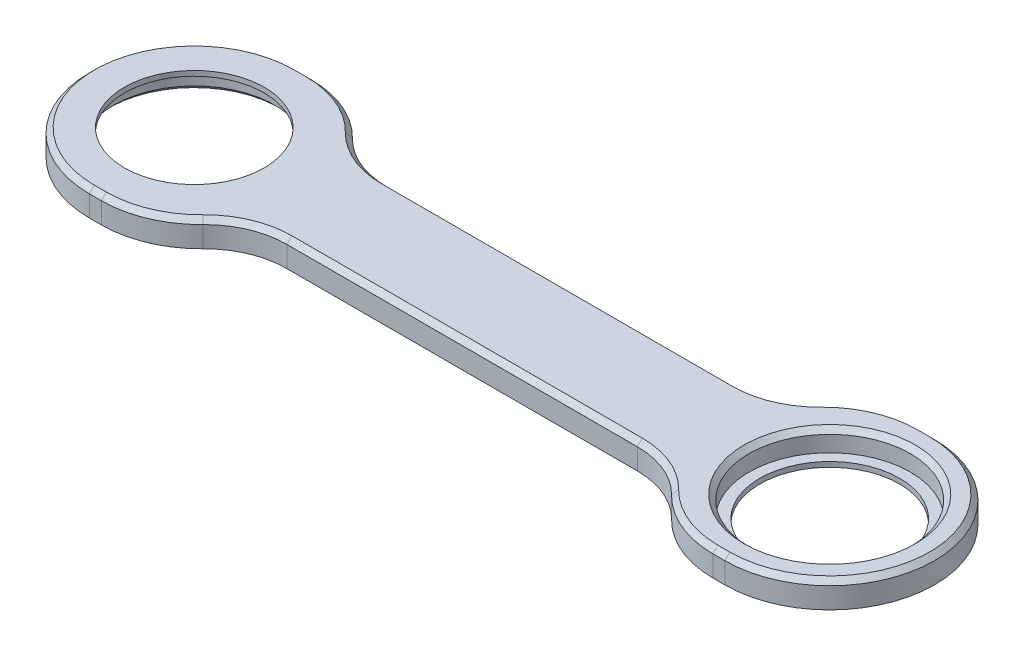
ISO-10303-21;
HEADER;
FILE_DESCRIPTION(('STEP AP214'),'2;1');
FILE_NAME('part.step','',(''),(''),'','','');
FILE_SCHEMA(('AUTOMOTIVE_DESIGN { 1 0 10303 214 1 1 1 1 }'));
ENDSEC;
DATA;
#1=APPLICATION_CONTEXT('core data for automotive mechanical design processes');
#2=APPLICATION_PROTOCOL_DEFINITION('international standard','automotive_design',2000,#1);
#3=PRODUCT_CONTEXT('',#1,'mechanical');
#4=PRODUCT('Part','Part','',(#3));
#5=PRODUCT_RELATED_PRODUCT_CATEGORY('part','',(#4));
#6=PRODUCT_DEFINITION_FORMATION('','',#4);
#7=PRODUCT_DEFINITION_CONTEXT('part definition',#1,'design');
#8=PRODUCT_DEFINITION('design','',#6,#7);
#9=PRODUCT_DEFINITION_SHAPE('','',#8);
#10=(LENGTH_UNIT() NAMED_UNIT(*) SI_UNIT(.MILLI.,.METRE.));
#11=(NAMED_UNIT(*) PLANE_ANGLE_UNIT() SI_UNIT($,.RADIAN.));
#12=(NAMED_UNIT(*) SI_UNIT($,.STERADIAN.) SOLID_ANGLE_UNIT());
#13=UNCERTAINTY_MEASURE_WITH_UNIT(LENGTH_MEASURE(1.E-05),#10,'distance_accuracy_value','');
#14=(GEOMETRIC_REPRESENTATION_CONTEXT(3) GLOBAL_UNCERTAINTY_ASSIGNED_CONTEXT((#13)) GLOBAL_UNIT_ASSIGNED_CONTEXT((#10,
#11,#12)) REPRESENTATION_CONTEXT('',''));
#15=CARTESIAN_POINT('',(0.,0.,0.));
#16=DIRECTION('',(0.,0.,1.));
#17=DIRECTION('',(1.,0.,0.));
#18=AXIS2_PLACEMENT_3D('',#15,#16,#17);
#19=CARTESIAN_POINT('',(-63.625,5.2,0.));
#20=DIRECTION('',(0.,-1.,0.));
#21=DIRECTION('',(0.,0.,-1.));
#22=AXIS2_PLACEMENT_3D('',#19,#20,#21);
#23=CYLINDRICAL_SURFACE('',#22,16.15);
#24=CARTESIAN_POINT('',(-63.625,0.99999999999997,0.));
#25=DIRECTION('',(0.,1.,0.));
#26=DIRECTION('',(0.,0.,1.));
#27=AXIS2_PLACEMENT_3D('',#24,#25,#26);
#28=CIRCLE('',#27,16.15);
#29=CARTESIAN_POINT('',(-63.625,0.99999999999997,16.15));
#30=VERTEX_POINT('',#29);
#31=EDGE_CURVE('E11',#30,#30,#28,.F.);
#32=ORIENTED_EDGE('',*,*,#31,.T.);
#33=EDGE_LOOP('',(#32));
#34=FACE_BOUND('',#33,.T.);
#35=CARTESIAN_POINT('',(-63.625,4.2,0.));
#36=DIRECTION('',(0.,1.,0.));
#37=DIRECTION('',(0.,0.,1.));
#38=AXIS2_PLACEMENT_3D('',#35,#36,#37);
#39=CIRCLE('',#38,16.15);
#40=CARTESIAN_POINT('',(-63.625,4.2,16.15));
#41=VERTEX_POINT('',#40);
#42=EDGE_CURVE('E413',#41,#41,#39,.T.);
#43=ORIENTED_EDGE('',*,*,#42,.T.);
#44=EDGE_LOOP('',(#43));
#45=FACE_BOUND('',#44,.T.);
#46=ADVANCED_FACE('F41',(#34,#45),#23,.F.);
#47=CARTESIAN_POINT('',(63.625,5.2,0.));
#48=DIRECTION('',(0.,-1.,0.));
#49=DIRECTION('',(0.,0.,-1.));
#50=AXIS2_PLACEMENT_3D('',#47,#48,#49);
#51=CYLINDRICAL_SURFACE('',#50,16.15);
#52=CARTESIAN_POINT('',(63.625,4.20000000000002,0.));
#53=DIRECTION('',(0.,1.,0.));
#54=DIRECTION('',(0.,0.,1.));
#55=AXIS2_PLACEMENT_3D('',#52,#53,#54);
#56=CIRCLE('',#55,16.15);
#57=CARTESIAN_POINT('',(63.625,4.20000000000002,16.15));
#58=VERTEX_POINT('',#57);
#59=EDGE_CURVE('E337',#58,#58,#56,.T.);
#60=ORIENTED_EDGE('',*,*,#59,.T.);
#61=EDGE_LOOP('',(#60));
#62=FACE_BOUND('',#61,.T.);
#63=CARTESIAN_POINT('',(63.625,1.,0.));
#64=DIRECTION('',(0.,-1.,0.));
#65=DIRECTION('',(0.,0.,-1.));
#66=AXIS2_PLACEMENT_3D('',#63,#64,#65);
#67=CIRCLE('',#66,16.15);
#68=CARTESIAN_POINT('',(63.625,1.,-16.15));
#69=VERTEX_POINT('',#68);
#70=EDGE_CURVE('E367',#69,#69,#67,.T.);
#71=ORIENTED_EDGE('',*,*,#70,.T.);
#72=EDGE_LOOP('',(#71));
#73=FACE_BOUND('',#72,.T.);
#74=ADVANCED_FACE('F432',(#62,#73),#51,.F.);
#75=CARTESIAN_POINT('',(35.1066134191231,5.2,26.5457507457693));
#76=DIRECTION('',(0.,-1.,0.));
#77=DIRECTION('',(0.,0.,-1.));
#78=AXIS2_PLACEMENT_3D('',#75,#76,#77);
#79=CYLINDRICAL_SURFACE('',#78,16.5457507457693);
#80=DIRECTION('',(0.,-1.,0.));
#81=VECTOR('',#80,1.);
#82=CARTESIAN_POINT('',(46.9387183735375,5.2,14.9801482932877));
#83=LINE('',#82,#81);
#84=CARTESIAN_POINT('',(46.9387183735375,0.,14.9801482932877));
#85=VERTEX_POINT('',#84);
#86=CARTESIAN_POINT('',(46.9387183735375,4.2,14.9801482932877));
#87=VERTEX_POINT('',#86);
#88=EDGE_CURVE('E278',#85,#87,#83,.F.);
#89=ORIENTED_EDGE('',*,*,#88,.T.);
#90=CARTESIAN_POINT('',(35.1066134191231,4.2,26.5457507457693));
#91=DIRECTION('',(0.,1.,0.));
#92=DIRECTION('',(0.,0.,1.));
#93=AXIS2_PLACEMENT_3D('',#90,#91,#92);
#94=CIRCLE('',#93,16.5457507457693);
#95=CARTESIAN_POINT('',(35.106613419123,4.2,9.99999999999998));
#96=VERTEX_POINT('',#95);
#97=EDGE_CURVE('E57',#87,#96,#94,.T.);
#98=ORIENTED_EDGE('',*,*,#97,.T.);
#99=DIRECTION('',(0.,-1.,0.));
#100=VECTOR('',#99,1.);
#101=CARTESIAN_POINT('',(35.106613419123,5.2,9.99999999999998));
#102=LINE('',#101,#100);
#103=CARTESIAN_POINT('',(35.106613419123,0.,9.99999999999998));
#104=VERTEX_POINT('',#103);
#105=EDGE_CURVE('E256',#96,#104,#102,.T.);
#106=ORIENTED_EDGE('',*,*,#105,.T.);
#107=CARTESIAN_POINT('',(35.1066134191231,0.,26.5457507457693));
#108=DIRECTION('',(0.,1.,0.));
#109=DIRECTION('',(0.,0.,1.));
#110=AXIS2_PLACEMENT_3D('',#107,#108,#109);
#111=CIRCLE('',#110,16.5457507457693);
#112=EDGE_CURVE('E229',#85,#104,#111,.T.);
#113=ORIENTED_EDGE('',*,*,#112,.F.);
#114=EDGE_LOOP('',(#89,#98,#106,#113));
#115=FACE_BOUND('',#114,.T.);
#116=ADVANCED_FACE('F438',(#115),#79,.F.);
#117=CARTESIAN_POINT('',(0.,5.2,21.));
#118=DIRECTION('',(0.,0.,1.));
#119=DIRECTION('',(1.,0.,0.));
#120=AXIS2_PLACEMENT_3D('',#117,#118,#119);
#121=PLANE('',#120);
#122=DIRECTION('',(0.,-1.,0.));
#123=VECTOR('',#122,1.);
#124=CARTESIAN_POINT('',(63.625,5.2,21.));
#125=LINE('',#124,#123);
#126=CARTESIAN_POINT('',(63.625,4.2,21.));
#127=VERTEX_POINT('',#126);
#128=CARTESIAN_POINT('',(63.625,0.,21.));
#129=VERTEX_POINT('',#128);
#130=EDGE_CURVE('E204',#127,#129,#125,.T.);
#131=ORIENTED_EDGE('',*,*,#130,.F.);
#132=DIRECTION('',(-1.,0.,0.));
#133=VECTOR('',#132,1.);
#134=CARTESIAN_POINT('',(0.,4.2,21.));
#135=LINE('',#134,#133);
#136=CARTESIAN_POINT('',(61.2410067812604,4.2,21.));
#137=VERTEX_POINT('',#136);
#138=EDGE_CURVE('E354',#127,#137,#135,.T.);
#139=ORIENTED_EDGE('',*,*,#138,.T.);
#140=DIRECTION('',(0.,-1.,0.));
#141=VECTOR('',#140,1.);
#142=CARTESIAN_POINT('',(61.2410067812604,5.2,21.));
#143=LINE('',#142,#141);
#144=CARTESIAN_POINT('',(61.2410067812604,0.,21.));
#145=VERTEX_POINT('',#144);
#146=EDGE_CURVE('E214',#137,#145,#143,.T.);
#147=ORIENTED_EDGE('',*,*,#146,.T.);
#148=DIRECTION('',(-1.,0.,0.));
#149=VECTOR('',#148,1.);
#150=CARTESIAN_POINT('',(0.,0.,21.));
#151=LINE('',#150,#149);
#152=EDGE_CURVE('E222',#129,#145,#151,.T.);
#153=ORIENTED_EDGE('',*,*,#152,.F.);
#154=EDGE_LOOP('',(#131,#139,#147,#153));
#155=FACE_BOUND('',#154,.T.);
#156=ADVANCED_FACE('F226',(#155),#121,.T.);
#157=CARTESIAN_POINT('',(63.625,5.2,0.));
#158=DIRECTION('',(0.,-1.,0.));
#159=DIRECTION('',(0.,0.,-1.));
#160=AXIS2_PLACEMENT_3D('',#157,#158,#159);
#161=CYLINDRICAL_SURFACE('',#160,21.);
#162=DIRECTION('',(0.,-1.,0.));
#163=VECTOR('',#162,1.);
#164=CARTESIAN_POINT('',(63.625,5.2,-21.));
#165=LINE('',#164,#163);
#166=CARTESIAN_POINT('',(63.625,4.2,-21.));
#167=VERTEX_POINT('',#166);
#168=CARTESIAN_POINT('',(63.625,0.,-21.));
#169=VERTEX_POINT('',#168);
#170=EDGE_CURVE('E215',#167,#169,#165,.T.);
#171=ORIENTED_EDGE('',*,*,#170,.F.);
#172=CARTESIAN_POINT('',(63.625,4.19999999999999,0.));
#173=DIRECTION('',(0.,1.,0.));
#174=DIRECTION('',(0.,0.,1.));
#175=AXIS2_PLACEMENT_3D('',#172,#173,#174);
#176=CIRCLE('',#175,21.);
#177=EDGE_CURVE('E210',#167,#127,#176,.F.);
#178=ORIENTED_EDGE('',*,*,#177,.T.);
#179=ORIENTED_EDGE('',*,*,#130,.T.);
#180=CARTESIAN_POINT('',(63.625,0.,0.));
#181=DIRECTION('',(0.,1.,0.));
#182=DIRECTION('',(0.,0.,1.));
#183=AXIS2_PLACEMENT_3D('',#180,#181,#182);
#184=CIRCLE('',#183,21.);
#185=EDGE_CURVE('E208',#129,#169,#184,.T.);
#186=ORIENTED_EDGE('',*,*,#185,.T.);
#187=EDGE_LOOP('',(#171,#178,#179,#186));
#188=FACE_BOUND('',#187,.T.);
#189=ADVANCED_FACE('F207',(#188),#161,.T.);
#190=CARTESIAN_POINT('',(0.,5.2,-21.));
#191=DIRECTION('',(0.,0.,1.));
#192=DIRECTION('',(1.,0.,0.));
#193=AXIS2_PLACEMENT_3D('',#190,#191,#192);
#194=PLANE('',#193);
#195=DIRECTION('',(0.,1.,0.));
#196=VECTOR('',#195,1.);
#197=CARTESIAN_POINT('',(61.2410067812603,5.2,-21.));
#198=LINE('',#197,#196);
#199=CARTESIAN_POINT('',(61.2410067812603,0.,-21.));
#200=VERTEX_POINT('',#199);
#201=CARTESIAN_POINT('',(61.2410067812603,4.2,-21.));
#202=VERTEX_POINT('',#201);
#203=EDGE_CURVE('E282',#200,#202,#198,.T.);
#204=ORIENTED_EDGE('',*,*,#203,.T.);
#205=DIRECTION('',(1.,0.,0.));
#206=VECTOR('',#205,1.);
#207=CARTESIAN_POINT('',(63.625,4.2,-21.));
#208=LINE('',#207,#206);
#209=EDGE_CURVE('E350',#202,#167,#208,.T.);
#210=ORIENTED_EDGE('',*,*,#209,.T.);
#211=ORIENTED_EDGE('',*,*,#170,.T.);
#212=DIRECTION('',(-1.,0.,0.));
#213=VECTOR('',#212,1.);
#214=CARTESIAN_POINT('',(0.,0.,-21.));
#215=LINE('',#214,#213);
#216=EDGE_CURVE('E224',#169,#200,#215,.T.);
#217=ORIENTED_EDGE('',*,*,#216,.T.);
#218=EDGE_LOOP('',(#204,#210,#211,#217));
#219=FACE_BOUND('',#218,.T.);
#220=ADVANCED_FACE('F465',(#219),#194,.F.);
#221=CARTESIAN_POINT('',(35.1066134191231,5.2,-26.5457507457693));
#222=DIRECTION('',(0.,-1.,0.));
#223=DIRECTION('',(0.,0.,-1.));
#224=AXIS2_PLACEMENT_3D('',#221,#222,#223);
#225=CYLINDRICAL_SURFACE('',#224,16.5457507457693);
#226=DIRECTION('',(0.,-1.,0.));
#227=VECTOR('',#226,1.);
#228=CARTESIAN_POINT('',(35.106613419123,5.2,-9.99999999999999));
#229=LINE('',#228,#227);
#230=CARTESIAN_POINT('',(35.106613419123,4.2,-9.99999999999999));
#231=VERTEX_POINT('',#230);
#232=CARTESIAN_POINT('',(35.106613419123,0.,-9.99999999999999));
#233=VERTEX_POINT('',#232);
#234=EDGE_CURVE('E266',#231,#233,#229,.T.);
#235=ORIENTED_EDGE('',*,*,#234,.F.);
#236=CARTESIAN_POINT('',(35.1066134191231,4.2,-26.5457507457693));
#237=DIRECTION('',(0.,1.,0.));
#238=DIRECTION('',(0.,0.,1.));
#239=AXIS2_PLACEMENT_3D('',#236,#237,#238);
#240=CIRCLE('',#239,16.5457507457693);
#241=CARTESIAN_POINT('',(46.9387183735375,4.2,-14.9801482932877));
#242=VERTEX_POINT('',#241);
#243=EDGE_CURVE('E342',#231,#242,#240,.T.);
#244=ORIENTED_EDGE('',*,*,#243,.T.);
#245=DIRECTION('',(0.,-1.,0.));
#246=VECTOR('',#245,1.);
#247=CARTESIAN_POINT('',(46.9387183735375,5.2,-14.9801482932877));
#248=LINE('',#247,#246);
#249=CARTESIAN_POINT('',(46.9387183735375,0.,-14.9801482932877));
#250=VERTEX_POINT('',#249);
#251=EDGE_CURVE('E280',#242,#250,#248,.T.);
#252=ORIENTED_EDGE('',*,*,#251,.T.);
#253=CARTESIAN_POINT('',(35.1066134191231,0.,-26.5457507457693));
#254=DIRECTION('',(0.,1.,0.));
#255=DIRECTION('',(0.,0.,1.));
#256=AXIS2_PLACEMENT_3D('',#253,#254,#255);
#257=CIRCLE('',#256,16.5457507457693);
#258=EDGE_CURVE('E975',#233,#250,#257,.T.);
#259=ORIENTED_EDGE('',*,*,#258,.F.);
#260=EDGE_LOOP('',(#235,#244,#252,#259));
#261=FACE_BOUND('',#260,.T.);
#262=ADVANCED_FACE('F472',(#261),#225,.F.);
#263=CARTESIAN_POINT('',(0.,5.2,-9.99999999999999));
#264=DIRECTION('',(0.,0.,-1.));
#265=DIRECTION('',(-1.,0.,0.));
#266=AXIS2_PLACEMENT_3D('',#263,#264,#265);
#267=PLANE('',#266);
#268=DIRECTION('',(0.,-1.,0.));
#269=VECTOR('',#268,1.);
#270=CARTESIAN_POINT('',(-35.106613419123,5.2,-9.99999999999999));
#271=LINE('',#270,#269);
#272=CARTESIAN_POINT('',(-35.106613419123,4.2,-9.99999999999999));
#273=VERTEX_POINT('',#272);
#274=CARTESIAN_POINT('',(-35.106613419123,0.,-9.99999999999999));
#275=VERTEX_POINT('',#274);
#276=EDGE_CURVE('E264',#273,#275,#271,.T.);
#277=ORIENTED_EDGE('',*,*,#276,.F.);
#278=DIRECTION('',(1.,0.,0.));
#279=VECTOR('',#278,1.);
#280=CARTESIAN_POINT('',(0.,4.20000000000003,-9.99999999999999));
#281=LINE('',#280,#279);
#282=EDGE_CURVE('E335',#273,#231,#281,.T.);
#283=ORIENTED_EDGE('',*,*,#282,.T.);
#284=ORIENTED_EDGE('',*,*,#234,.T.);
#285=DIRECTION('',(1.,0.,0.));
#286=VECTOR('',#285,1.);
#287=CARTESIAN_POINT('',(0.,0.,-9.99999999999999));
#288=LINE('',#287,#286);
#289=EDGE_CURVE('E977',#275,#233,#288,.T.);
#290=ORIENTED_EDGE('',*,*,#289,.F.);
#291=EDGE_LOOP('',(#277,#283,#284,#290));
#292=FACE_BOUND('',#291,.T.);
#293=ADVANCED_FACE('F468',(#292),#267,.T.);
#294=CARTESIAN_POINT('',(-35.1066134191231,5.2,-26.5457507457693));
#295=DIRECTION('',(0.,-1.,0.));
#296=DIRECTION('',(0.,0.,-1.));
#297=AXIS2_PLACEMENT_3D('',#294,#295,#296);
#298=CYLINDRICAL_SURFACE('',#297,16.5457507457693);
#299=DIRECTION('',(0.,-1.,0.));
#300=VECTOR('',#299,1.);
#301=CARTESIAN_POINT('',(-46.9387183735375,5.2,-14.9801482932877));
#302=LINE('',#301,#300);
#303=CARTESIAN_POINT('',(-46.9387183735375,0.,-14.9801482932877));
#304=VERTEX_POINT('',#303);
#305=CARTESIAN_POINT('',(-46.9387183735375,4.2,-14.9801482932877));
#306=VERTEX_POINT('',#305);
#307=EDGE_CURVE('E287',#304,#306,#302,.F.);
#308=ORIENTED_EDGE('',*,*,#307,.T.);
#309=CARTESIAN_POINT('',(-35.1066134191231,4.2,-26.5457507457693));
#310=DIRECTION('',(0.,1.,0.));
#311=DIRECTION('',(0.,0.,1.));
#312=AXIS2_PLACEMENT_3D('',#309,#310,#311);
#313=CIRCLE('',#312,16.5457507457693);
#314=EDGE_CURVE('E340',#306,#273,#313,.T.);
#315=ORIENTED_EDGE('',*,*,#314,.T.);
#316=ORIENTED_EDGE('',*,*,#276,.T.);
#317=CARTESIAN_POINT('',(-35.1066134191231,0.,-26.5457507457693));
#318=DIRECTION('',(0.,1.,0.));
#319=DIRECTION('',(0.,0.,1.));
#320=AXIS2_PLACEMENT_3D('',#317,#318,#319);
#321=CIRCLE('',#320,16.5457507457693);
#322=EDGE_CURVE('E249',#304,#275,#321,.T.);
#323=ORIENTED_EDGE('',*,*,#322,.F.);
#324=EDGE_LOOP('',(#308,#315,#316,#323));
#325=FACE_BOUND('',#324,.T.);
#326=ADVANCED_FACE('F463',(#325),#298,.F.);
#327=DIRECTION('',(0.,-1.,0.));
#328=VECTOR('',#327,1.);
#329=CARTESIAN_POINT('',(-63.625,5.2,-21.));
#330=LINE('',#329,#328);
#331=CARTESIAN_POINT('',(-63.625,4.2,-21.));
#332=VERTEX_POINT('',#331);
#333=CARTESIAN_POINT('',(-63.625,0.,-21.));
#334=VERTEX_POINT('',#333);
#335=EDGE_CURVE('E262',#332,#334,#330,.T.);
#336=ORIENTED_EDGE('',*,*,#335,.F.);
#337=DIRECTION('',(1.,0.,0.));
#338=VECTOR('',#337,1.);
#339=CARTESIAN_POINT('',(-61.2410067812603,4.2,-21.));
#340=LINE('',#339,#338);
#341=CARTESIAN_POINT('',(-61.2410067812603,4.2,-21.));
#342=VERTEX_POINT('',#341);
#343=EDGE_CURVE('E348',#332,#342,#340,.T.);
#344=ORIENTED_EDGE('',*,*,#343,.T.);
#345=DIRECTION('',(0.,1.,0.));
#346=VECTOR('',#345,1.);
#347=CARTESIAN_POINT('',(-61.2410067812603,0.,-21.));
#348=LINE('',#347,#346);
#349=CARTESIAN_POINT('',(-61.2410067812603,0.,-21.));
#350=VERTEX_POINT('',#349);
#351=EDGE_CURVE('E285',#342,#350,#348,.F.);
#352=ORIENTED_EDGE('',*,*,#351,.T.);
#353=EDGE_CURVE('E244',#350,#334,#215,.T.);
#354=ORIENTED_EDGE('',*,*,#353,.T.);
#355=EDGE_LOOP('',(#336,#344,#352,#354));
#356=FACE_BOUND('',#355,.T.);
#357=ADVANCED_FACE('F460',(#356),#194,.F.);
#358=CARTESIAN_POINT('',(-63.625,5.2,0.));
#359=DIRECTION('',(0.,-1.,0.));
#360=DIRECTION('',(0.,0.,-1.));
#361=AXIS2_PLACEMENT_3D('',#358,#359,#360);
#362=CYLINDRICAL_SURFACE('',#361,21.);
#363=DIRECTION('',(0.,-1.,0.));
#364=VECTOR('',#363,1.);
#365=CARTESIAN_POINT('',(-63.625,5.2,21.));
#366=LINE('',#365,#364);
#367=CARTESIAN_POINT('',(-63.625,4.2,21.));
#368=VERTEX_POINT('',#367);
#369=CARTESIAN_POINT('',(-63.625,0.,21.));
#370=VERTEX_POINT('',#369);
#371=EDGE_CURVE('E260',#368,#370,#366,.T.);
#372=ORIENTED_EDGE('',*,*,#371,.F.);
#373=CARTESIAN_POINT('',(-63.625,4.2,0.));
#374=DIRECTION('',(0.,1.,0.));
#375=DIRECTION('',(0.,0.,1.));
#376=AXIS2_PLACEMENT_3D('',#373,#374,#375);
#377=CIRCLE('',#376,21.);
#378=EDGE_CURVE('E352',#368,#332,#377,.F.);
#379=ORIENTED_EDGE('',*,*,#378,.T.);
#380=ORIENTED_EDGE('',*,*,#335,.T.);
#381=CARTESIAN_POINT('',(-63.625,0.,0.));
#382=DIRECTION('',(0.,1.,0.));
#383=DIRECTION('',(0.,0.,1.));
#384=AXIS2_PLACEMENT_3D('',#381,#382,#383);
#385=CIRCLE('',#384,21.);
#386=EDGE_CURVE('E237',#334,#370,#385,.T.);
#387=ORIENTED_EDGE('',*,*,#386,.T.);
#388=EDGE_LOOP('',(#372,#379,#380,#387));
#389=FACE_BOUND('',#388,.T.);
#390=ADVANCED_FACE('F456',(#389),#362,.T.);
#391=DIRECTION('',(0.,-1.,0.));
#392=VECTOR('',#391,1.);
#393=CARTESIAN_POINT('',(-61.2410067812604,5.2,21.));
#394=LINE('',#393,#392);
#395=CARTESIAN_POINT('',(-61.2410067812604,0.,21.));
#396=VERTEX_POINT('',#395);
#397=CARTESIAN_POINT('',(-61.2410067812604,4.2,21.));
#398=VERTEX_POINT('',#397);
#399=EDGE_CURVE('E292',#396,#398,#394,.F.);
#400=ORIENTED_EDGE('',*,*,#399,.T.);
#401=DIRECTION('',(-1.,0.,0.));
#402=VECTOR('',#401,1.);
#403=CARTESIAN_POINT('',(0.,4.20000000000001,21.));
#404=LINE('',#403,#402);
#405=EDGE_CURVE('E295',#398,#368,#404,.T.);
#406=ORIENTED_EDGE('',*,*,#405,.T.);
#407=ORIENTED_EDGE('',*,*,#371,.T.);
#408=EDGE_CURVE('E231',#396,#370,#151,.T.);
#409=ORIENTED_EDGE('',*,*,#408,.F.);
#410=EDGE_LOOP('',(#400,#406,#407,#409));
#411=FACE_BOUND('',#410,.T.);
#412=ADVANCED_FACE('F452',(#411),#121,.T.);
#413=CARTESIAN_POINT('',(-35.1066134191231,5.2,26.5457507457693));
#414=DIRECTION('',(0.,-1.,0.));
#415=DIRECTION('',(0.,0.,-1.));
#416=AXIS2_PLACEMENT_3D('',#413,#414,#415);
#417=CYLINDRICAL_SURFACE('',#416,16.5457507457693);
#418=DIRECTION('',(0.,-1.,0.));
#419=VECTOR('',#418,1.);
#420=CARTESIAN_POINT('',(-35.106613419123,5.2,9.99999999999998));
#421=LINE('',#420,#419);
#422=CARTESIAN_POINT('',(-35.106613419123,4.2,9.99999999999998));
#423=VERTEX_POINT('',#422);
#424=CARTESIAN_POINT('',(-35.106613419123,0.,9.99999999999998));
#425=VERTEX_POINT('',#424);
#426=EDGE_CURVE('E258',#423,#425,#421,.T.);
#427=ORIENTED_EDGE('',*,*,#426,.F.);
#428=CARTESIAN_POINT('',(-35.1066134191231,4.2,26.5457507457693));
#429=DIRECTION('',(0.,1.,0.));
#430=DIRECTION('',(0.,0.,1.));
#431=AXIS2_PLACEMENT_3D('',#428,#429,#430);
#432=CIRCLE('',#431,16.5457507457693);
#433=CARTESIAN_POINT('',(-46.9387183735375,4.2,14.9801482932877));
#434=VERTEX_POINT('',#433);
#435=EDGE_CURVE('E360',#423,#434,#432,.T.);
#436=ORIENTED_EDGE('',*,*,#435,.T.);
#437=DIRECTION('',(0.,-1.,0.));
#438=VECTOR('',#437,1.);
#439=CARTESIAN_POINT('',(-46.9387183735375,5.2,14.9801482932877));
#440=LINE('',#439,#438);
#441=CARTESIAN_POINT('',(-46.9387183735375,0.,14.9801482932877));
#442=VERTEX_POINT('',#441);
#443=EDGE_CURVE('E290',#434,#442,#440,.T.);
#444=ORIENTED_EDGE('',*,*,#443,.T.);
#445=CARTESIAN_POINT('',(-35.1066134191231,0.,26.5457507457693));
#446=DIRECTION('',(0.,1.,0.));
#447=DIRECTION('',(0.,0.,1.));
#448=AXIS2_PLACEMENT_3D('',#445,#446,#447);
#449=CIRCLE('',#448,16.5457507457693);
#450=EDGE_CURVE('E236',#425,#442,#449,.T.);
#451=ORIENTED_EDGE('',*,*,#450,.F.);
#452=EDGE_LOOP('',(#427,#436,#444,#451));
#453=FACE_BOUND('',#452,.T.);
#454=ADVANCED_FACE('F449',(#453),#417,.F.);
#455=CARTESIAN_POINT('',(0.,5.2,9.99999999999998));
#456=DIRECTION('',(0.,0.,-1.));
#457=DIRECTION('',(-1.,0.,0.));
#458=AXIS2_PLACEMENT_3D('',#455,#456,#457);
#459=PLANE('',#458);
#460=ORIENTED_EDGE('',*,*,#105,.F.);
#461=DIRECTION('',(-1.,0.,0.));
#462=VECTOR('',#461,1.);
#463=CARTESIAN_POINT('',(-35.106613419123,4.2,9.99999999999998));
#464=LINE('',#463,#462);
#465=EDGE_CURVE('E64',#96,#423,#464,.T.);
#466=ORIENTED_EDGE('',*,*,#465,.T.);
#467=ORIENTED_EDGE('',*,*,#426,.T.);
#468=DIRECTION('',(1.,0.,0.));
#469=VECTOR('',#468,1.);
#470=CARTESIAN_POINT('',(0.,0.,9.99999999999998));
#471=LINE('',#470,#469);
#472=EDGE_CURVE('E242',#425,#104,#471,.T.);
#473=ORIENTED_EDGE('',*,*,#472,.T.);
#474=EDGE_LOOP('',(#460,#466,#467,#473));
#475=FACE_BOUND('',#474,.T.);
#476=ADVANCED_FACE('F445',(#475),#459,.F.);
#477=CARTESIAN_POINT('',(0.,5.2,0.));
#478=DIRECTION('',(0.,1.,0.));
#479=DIRECTION('',(0.,0.,1.));
#480=AXIS2_PLACEMENT_3D('',#477,#478,#479);
#481=PLANE('',#480);
#482=CARTESIAN_POINT('',(63.625,5.2,0.));
#483=DIRECTION('',(0.,1.,0.));
#484=DIRECTION('',(0.,0.,1.));
#485=AXIS2_PLACEMENT_3D('',#482,#483,#484);
#486=CIRCLE('',#485,17.15);
#487=CARTESIAN_POINT('',(63.625,5.2,17.15));
#488=VERTEX_POINT('',#487);
#489=EDGE_CURVE('E331',#488,#488,#486,.F.);
#490=ORIENTED_EDGE('',*,*,#489,.T.);
#491=EDGE_LOOP('',(#490));
#492=FACE_BOUND('',#491,.T.);
#493=CARTESIAN_POINT('',(35.1066134191231,5.2,-26.5457507457693));
#494=DIRECTION('',(0.,1.,0.));
#495=DIRECTION('',(0.,0.,1.));
#496=AXIS2_PLACEMENT_3D('',#493,#494,#495);
#497=CIRCLE('',#496,17.5457507457693);
#498=CARTESIAN_POINT('',(47.6538327939236,5.2,-14.2811408786234));
#499=VERTEX_POINT('',#498);
#500=CARTESIAN_POINT('',(35.106613419123,5.2,-9.));
#501=VERTEX_POINT('',#500);
#502=EDGE_CURVE('E325',#499,#501,#497,.F.);
#503=ORIENTED_EDGE('',*,*,#502,.T.);
#504=DIRECTION('',(-1.,0.,0.));
#505=VECTOR('',#504,1.);
#506=CARTESIAN_POINT('',(0.,5.2,-9.));
#507=LINE('',#506,#505);
#508=CARTESIAN_POINT('',(-35.106613419123,5.2,-9.));
#509=VERTEX_POINT('',#508);
#510=EDGE_CURVE('E329',#501,#509,#507,.T.);
#511=ORIENTED_EDGE('',*,*,#510,.T.);
#512=CARTESIAN_POINT('',(-35.1066134191231,5.2,-26.5457507457693));
#513=DIRECTION('',(0.,1.,0.));
#514=DIRECTION('',(0.,0.,1.));
#515=AXIS2_PLACEMENT_3D('',#512,#513,#514);
#516=CIRCLE('',#515,17.5457507457693);
#517=CARTESIAN_POINT('',(-47.6538327939236,5.2,-14.2811408786234));
#518=VERTEX_POINT('',#517);
#519=EDGE_CURVE('E327',#509,#518,#516,.F.);
#520=ORIENTED_EDGE('',*,*,#519,.T.);
#521=CARTESIAN_POINT('',(-61.2410067812603,5.2,-0.999999999999994));
#522=DIRECTION('',(0.,1.,0.));
#523=DIRECTION('',(0.,0.,1.));
#524=AXIS2_PLACEMENT_3D('',#521,#522,#523);
#525=CIRCLE('',#524,19.);
#526=CARTESIAN_POINT('',(-61.2410067812603,5.2,-20.));
#527=VERTEX_POINT('',#526);
#528=EDGE_CURVE('E323',#518,#527,#525,.T.);
#529=ORIENTED_EDGE('',*,*,#528,.T.);
#530=DIRECTION('',(-1.,0.,0.));
#531=VECTOR('',#530,1.);
#532=CARTESIAN_POINT('',(-63.625,5.2,-20.));
#533=LINE('',#532,#531);
#534=CARTESIAN_POINT('',(-63.625,5.2,-20.));
#535=VERTEX_POINT('',#534);
#536=EDGE_CURVE('E319',#527,#535,#533,.T.);
#537=ORIENTED_EDGE('',*,*,#536,.T.);
#538=CARTESIAN_POINT('',(-63.625,5.2,0.));
#539=DIRECTION('',(0.,1.,0.));
#540=DIRECTION('',(0.,0.,1.));
#541=AXIS2_PLACEMENT_3D('',#538,#539,#540);
#542=CIRCLE('',#541,20.);
#543=CARTESIAN_POINT('',(-63.625,5.2,20.));
#544=VERTEX_POINT('',#543);
#545=EDGE_CURVE('E315',#535,#544,#542,.T.);
#546=ORIENTED_EDGE('',*,*,#545,.T.);
#547=DIRECTION('',(1.,0.,0.));
#548=VECTOR('',#547,1.);
#549=CARTESIAN_POINT('',(0.,5.2,20.));
#550=LINE('',#549,#548);
#551=CARTESIAN_POINT('',(-61.2410067812604,5.2,20.));
#552=VERTEX_POINT('',#551);
#553=EDGE_CURVE('E312',#544,#552,#550,.T.);
#554=ORIENTED_EDGE('',*,*,#553,.T.);
#555=CARTESIAN_POINT('',(-61.2410067812604,5.2,1.00000000000002));
#556=DIRECTION('',(0.,1.,0.));
#557=DIRECTION('',(0.,0.,1.));
#558=AXIS2_PLACEMENT_3D('',#555,#556,#557);
#559=CIRCLE('',#558,19.);
#560=CARTESIAN_POINT('',(-47.6538327939236,5.2,14.2811408786234));
#561=VERTEX_POINT('',#560);
#562=EDGE_CURVE('E306',#552,#561,#559,.T.);
#563=ORIENTED_EDGE('',*,*,#562,.T.);
#564=CARTESIAN_POINT('',(-35.1066134191231,5.2,26.5457507457693));
#565=DIRECTION('',(0.,1.,0.));
#566=DIRECTION('',(0.,0.,1.));
#567=AXIS2_PLACEMENT_3D('',#564,#565,#566);
#568=CIRCLE('',#567,17.5457507457693);
#569=CARTESIAN_POINT('',(-35.106613419123,5.2,8.99999999999999));
#570=VERTEX_POINT('',#569);
#571=EDGE_CURVE('E302',#561,#570,#568,.F.);
#572=ORIENTED_EDGE('',*,*,#571,.T.);
#573=DIRECTION('',(1.,0.,0.));
#574=VECTOR('',#573,1.);
#575=CARTESIAN_POINT('',(35.106613419123,5.2,8.99999999999999));
#576=LINE('',#575,#574);
#577=CARTESIAN_POINT('',(35.106613419123,5.2,8.99999999999999));
#578=VERTEX_POINT('',#577);
#579=EDGE_CURVE('E298',#570,#578,#576,.T.);
#580=ORIENTED_EDGE('',*,*,#579,.T.);
#581=CARTESIAN_POINT('',(35.1066134191231,5.2,26.5457507457693));
#582=DIRECTION('',(0.,1.,0.));
#583=DIRECTION('',(0.,0.,1.));
#584=AXIS2_PLACEMENT_3D('',#581,#582,#583);
#585=CIRCLE('',#584,17.5457507457693);
#586=CARTESIAN_POINT('',(47.6538327939236,5.2,14.2811408786234));
#587=VERTEX_POINT('',#586);
#588=EDGE_CURVE('E300',#578,#587,#585,.F.);
#589=ORIENTED_EDGE('',*,*,#588,.T.);
#590=CARTESIAN_POINT('',(61.2410067812604,5.2,1.00000000000002));
#591=DIRECTION('',(0.,1.,0.));
#592=DIRECTION('',(0.,0.,1.));
#593=AXIS2_PLACEMENT_3D('',#590,#591,#592);
#594=CIRCLE('',#593,19.);
#595=CARTESIAN_POINT('',(61.2410067812604,5.2,20.));
#596=VERTEX_POINT('',#595);
#597=EDGE_CURVE('E304',#587,#596,#594,.T.);
#598=ORIENTED_EDGE('',*,*,#597,.T.);
#599=DIRECTION('',(1.,0.,0.));
#600=VECTOR('',#599,1.);
#601=CARTESIAN_POINT('',(0.,5.2,20.));
#602=LINE('',#601,#600);
#603=CARTESIAN_POINT('',(63.625,5.2,20.));
#604=VERTEX_POINT('',#603);
#605=EDGE_CURVE('E308',#596,#604,#602,.T.);
#606=ORIENTED_EDGE('',*,*,#605,.T.);
#607=CARTESIAN_POINT('',(63.625,5.2,0.));
#608=DIRECTION('',(0.,1.,0.));
#609=DIRECTION('',(0.,0.,1.));
#610=AXIS2_PLACEMENT_3D('',#607,#608,#609);
#611=CIRCLE('',#610,20.);
#612=CARTESIAN_POINT('',(63.625,5.2,-20.));
#613=VERTEX_POINT('',#612);
#614=EDGE_CURVE('E310',#604,#613,#611,.T.);
#615=ORIENTED_EDGE('',*,*,#614,.T.);
#616=DIRECTION('',(-1.,0.,0.));
#617=VECTOR('',#616,1.);
#618=CARTESIAN_POINT('',(61.2410067812603,5.2,-20.));
#619=LINE('',#618,#617);
#620=CARTESIAN_POINT('',(61.2410067812603,5.2,-20.));
#621=VERTEX_POINT('',#620);
#622=EDGE_CURVE('E317',#613,#621,#619,.T.);
#623=ORIENTED_EDGE('',*,*,#622,.T.);
#624=CARTESIAN_POINT('',(61.2410067812603,5.2,-0.999999999999994));
#625=DIRECTION('',(0.,1.,0.));
#626=DIRECTION('',(0.,0.,1.));
#627=AXIS2_PLACEMENT_3D('',#624,#625,#626);
#628=CIRCLE('',#627,19.);
#629=EDGE_CURVE('E321',#621,#499,#628,.T.);
#630=ORIENTED_EDGE('',*,*,#629,.T.);
#631=EDGE_LOOP('',(#503,#511,#520,#529,#537,#546,#554,#563,#572,#580,#589,#598,#606,#615,#623,#630));
#632=FACE_BOUND('',#631,.T.);
#633=CARTESIAN_POINT('',(-63.625,5.2,0.));
#634=DIRECTION('',(0.,1.,0.));
#635=DIRECTION('',(0.,0.,1.));
#636=AXIS2_PLACEMENT_3D('',#633,#634,#635);
#637=CIRCLE('',#636,14.);
#638=CARTESIAN_POINT('',(-63.625,5.2,14.));
#639=VERTEX_POINT('',#638);
#640=EDGE_CURVE('E635',#639,#639,#637,.T.);
#641=ORIENTED_EDGE('',*,*,#640,.F.);
#642=EDGE_LOOP('',(#641));
#643=FACE_BOUND('',#642,.T.);
#644=ADVANCED_FACE('F448',(#492,#632,#643),#481,.T.);
#645=CARTESIAN_POINT('',(0.,0.,0.));
#646=DIRECTION('',(0.,1.,0.));
#647=DIRECTION('',(0.,0.,1.));
#648=AXIS2_PLACEMENT_3D('',#645,#646,#647);
#649=PLANE('',#648);
#650=CARTESIAN_POINT('',(-63.625,0.,0.));
#651=DIRECTION('',(0.,1.,0.));
#652=DIRECTION('',(0.,0.,1.));
#653=AXIS2_PLACEMENT_3D('',#650,#651,#652);
#654=CIRCLE('',#653,17.15);
#655=CARTESIAN_POINT('',(-63.625,0.,17.15));
#656=VERTEX_POINT('',#655);
#657=EDGE_CURVE('E50',#656,#656,#654,.T.);
#658=ORIENTED_EDGE('',*,*,#657,.T.);
#659=EDGE_LOOP('',(#658));
#660=FACE_BOUND('',#659,.T.);
#661=ORIENTED_EDGE('',*,*,#152,.T.);
#662=CARTESIAN_POINT('',(61.2410067812604,0.,1.00000000000002));
#663=DIRECTION('',(0.,1.,0.));
#664=DIRECTION('',(0.,0.,1.));
#665=AXIS2_PLACEMENT_3D('',#662,#663,#664);
#666=CIRCLE('',#665,20.);
#667=EDGE_CURVE('E276',#145,#85,#666,.F.);
#668=ORIENTED_EDGE('',*,*,#667,.T.);
#669=ORIENTED_EDGE('',*,*,#112,.T.);
#670=ORIENTED_EDGE('',*,*,#472,.F.);
#671=ORIENTED_EDGE('',*,*,#450,.T.);
#672=CARTESIAN_POINT('',(-61.2410067812604,0.,1.00000000000002));
#673=DIRECTION('',(0.,1.,0.));
#674=DIRECTION('',(0.,0.,1.));
#675=AXIS2_PLACEMENT_3D('',#672,#673,#674);
#676=CIRCLE('',#675,20.);
#677=EDGE_CURVE('E270',#442,#396,#676,.F.);
#678=ORIENTED_EDGE('',*,*,#677,.T.);
#679=ORIENTED_EDGE('',*,*,#408,.T.);
#680=ORIENTED_EDGE('',*,*,#386,.F.);
#681=ORIENTED_EDGE('',*,*,#353,.F.);
#682=CARTESIAN_POINT('',(-61.2410067812603,0.,-0.999999999999994));
#683=DIRECTION('',(0.,1.,0.));
#684=DIRECTION('',(0.,0.,1.));
#685=AXIS2_PLACEMENT_3D('',#682,#683,#684);
#686=CIRCLE('',#685,20.);
#687=EDGE_CURVE('E272',#350,#304,#686,.F.);
#688=ORIENTED_EDGE('',*,*,#687,.T.);
#689=ORIENTED_EDGE('',*,*,#322,.T.);
#690=ORIENTED_EDGE('',*,*,#289,.T.);
#691=ORIENTED_EDGE('',*,*,#258,.T.);
#692=CARTESIAN_POINT('',(61.2410067812603,0.,-0.999999999999994));
#693=DIRECTION('',(0.,1.,0.));
#694=DIRECTION('',(0.,0.,1.));
#695=AXIS2_PLACEMENT_3D('',#692,#693,#694);
#696=CIRCLE('',#695,20.);
#697=EDGE_CURVE('E274',#250,#200,#696,.F.);
#698=ORIENTED_EDGE('',*,*,#697,.T.);
#699=ORIENTED_EDGE('',*,*,#216,.F.);
#700=ORIENTED_EDGE('',*,*,#185,.F.);
#701=EDGE_LOOP('',(#661,#668,#669,#670,#671,#678,#679,#680,#681,#688,#689,#690,#691,#698,#699,#700));
#702=FACE_BOUND('',#701,.T.);
#703=CARTESIAN_POINT('',(63.625,0.,0.));
#704=DIRECTION('',(0.,-1.,0.));
#705=DIRECTION('',(0.,0.,-1.));
#706=AXIS2_PLACEMENT_3D('',#703,#704,#705);
#707=CIRCLE('',#706,14.);
#708=CARTESIAN_POINT('',(63.625,0.,-14.));
#709=VERTEX_POINT('',#708);
#710=EDGE_CURVE('E415',#709,#709,#707,.T.);
#711=ORIENTED_EDGE('',*,*,#710,.F.);
#712=EDGE_LOOP('',(#711));
#713=FACE_BOUND('',#712,.T.);
#714=ADVANCED_FACE('F220',(#660,#702,#713),#649,.F.);
#715=CARTESIAN_POINT('',(61.2410067812604,5.2,1.00000000000002));
#716=DIRECTION('',(0.,-1.,0.));
#717=DIRECTION('',(0.,0.,-1.));
#718=AXIS2_PLACEMENT_3D('',#715,#716,#717);
#719=CYLINDRICAL_SURFACE('',#718,20.);
#720=ORIENTED_EDGE('',*,*,#146,.F.);
#721=CARTESIAN_POINT('',(61.2410067812604,4.2,1.00000000000002));
#722=DIRECTION('',(0.,1.,0.));
#723=DIRECTION('',(0.,0.,1.));
#724=AXIS2_PLACEMENT_3D('',#721,#722,#723);
#725=CIRCLE('',#724,20.);
#726=EDGE_CURVE('E358',#137,#87,#725,.F.);
#727=ORIENTED_EDGE('',*,*,#726,.T.);
#728=ORIENTED_EDGE('',*,*,#88,.F.);
#729=ORIENTED_EDGE('',*,*,#667,.F.);
#730=EDGE_LOOP('',(#720,#727,#728,#729));
#731=FACE_BOUND('',#730,.T.);
#732=ADVANCED_FACE('F481',(#731),#719,.T.);
#733=CARTESIAN_POINT('',(61.2410067812603,5.2,-0.999999999999994));
#734=DIRECTION('',(0.,-1.,0.));
#735=DIRECTION('',(0.,0.,-1.));
#736=AXIS2_PLACEMENT_3D('',#733,#734,#735);
#737=CYLINDRICAL_SURFACE('',#736,20.);
#738=ORIENTED_EDGE('',*,*,#251,.F.);
#739=CARTESIAN_POINT('',(61.2410067812603,4.2,-0.999999999999994));
#740=DIRECTION('',(0.,1.,0.));
#741=DIRECTION('',(0.,0.,1.));
#742=AXIS2_PLACEMENT_3D('',#739,#740,#741);
#743=CIRCLE('',#742,20.);
#744=EDGE_CURVE('E346',#242,#202,#743,.F.);
#745=ORIENTED_EDGE('',*,*,#744,.T.);
#746=ORIENTED_EDGE('',*,*,#203,.F.);
#747=ORIENTED_EDGE('',*,*,#697,.F.);
#748=EDGE_LOOP('',(#738,#745,#746,#747));
#749=FACE_BOUND('',#748,.T.);
#750=ADVANCED_FACE('F484',(#749),#737,.T.);
#751=CARTESIAN_POINT('',(-61.2410067812603,5.2,-0.999999999999994));
#752=DIRECTION('',(0.,-1.,0.));
#753=DIRECTION('',(0.,0.,-1.));
#754=AXIS2_PLACEMENT_3D('',#751,#752,#753);
#755=CYLINDRICAL_SURFACE('',#754,20.);
#756=ORIENTED_EDGE('',*,*,#351,.F.);
#757=CARTESIAN_POINT('',(-61.2410067812603,4.2,-0.999999999999994));
#758=DIRECTION('',(0.,1.,0.));
#759=DIRECTION('',(0.,0.,1.));
#760=AXIS2_PLACEMENT_3D('',#757,#758,#759);
#761=CIRCLE('',#760,20.);
#762=EDGE_CURVE('E344',#342,#306,#761,.F.);
#763=ORIENTED_EDGE('',*,*,#762,.T.);
#764=ORIENTED_EDGE('',*,*,#307,.F.);
#765=ORIENTED_EDGE('',*,*,#687,.F.);
#766=EDGE_LOOP('',(#756,#763,#764,#765));
#767=FACE_BOUND('',#766,.T.);
#768=ADVANCED_FACE('F488',(#767),#755,.T.);
#769=CARTESIAN_POINT('',(-61.2410067812604,5.2,1.00000000000002));
#770=DIRECTION('',(0.,-1.,0.));
#771=DIRECTION('',(0.,0.,-1.));
#772=AXIS2_PLACEMENT_3D('',#769,#770,#771);
#773=CYLINDRICAL_SURFACE('',#772,20.);
#774=ORIENTED_EDGE('',*,*,#443,.F.);
#775=CARTESIAN_POINT('',(-61.2410067812604,4.2,1.00000000000002));
#776=DIRECTION('',(0.,1.,0.));
#777=DIRECTION('',(0.,0.,1.));
#778=AXIS2_PLACEMENT_3D('',#775,#776,#777);
#779=CIRCLE('',#778,20.);
#780=EDGE_CURVE('E356',#434,#398,#779,.F.);
#781=ORIENTED_EDGE('',*,*,#780,.T.);
#782=ORIENTED_EDGE('',*,*,#399,.F.);
#783=ORIENTED_EDGE('',*,*,#677,.F.);
#784=EDGE_LOOP('',(#774,#781,#782,#783));
#785=FACE_BOUND('',#784,.T.);
#786=ADVANCED_FACE('F492',(#785),#773,.T.);
#787=CARTESIAN_POINT('',(0.,5.2,-20.));
#788=DIRECTION('',(0.,0.707106781186543,-0.707106781186552));
#789=DIRECTION('',(1.,0.,0.));
#790=AXIS2_PLACEMENT_3D('',#787,#788,#789);
#791=PLANE('',#790);
#792=DIRECTION('',(0.,-0.707106781186552,-0.707106781186543));
#793=VECTOR('',#792,1.);
#794=CARTESIAN_POINT('',(61.2410067812603,5.2,-20.));
#795=LINE('',#794,#793);
#796=EDGE_CURVE('E405',#621,#202,#795,.T.);
#797=ORIENTED_EDGE('',*,*,#796,.F.);
#798=ORIENTED_EDGE('',*,*,#622,.F.);
#799=DIRECTION('',(0.,0.707106781186552,0.707106781186543));
#800=VECTOR('',#799,1.);
#801=CARTESIAN_POINT('',(63.625,4.2,-21.));
#802=LINE('',#801,#800);
#803=EDGE_CURVE('E233',#167,#613,#802,.T.);
#804=ORIENTED_EDGE('',*,*,#803,.F.);
#805=ORIENTED_EDGE('',*,*,#209,.F.);
#806=EDGE_LOOP('',(#797,#798,#804,#805));
#807=FACE_BOUND('',#806,.T.);
#808=ADVANCED_FACE('F496',(#807),#791,.T.);
#809=CARTESIAN_POINT('',(63.625,5.2,0.));
#810=DIRECTION('',(0.,-1.,0.));
#811=DIRECTION('',(0.,0.,-1.));
#812=AXIS2_PLACEMENT_3D('',#809,#810,#811);
#813=CONICAL_SURFACE('',#812,20.,0.78539816339745);
#814=ORIENTED_EDGE('',*,*,#803,.T.);
#815=ORIENTED_EDGE('',*,*,#614,.F.);
#816=DIRECTION('',(0.,0.707106781186546,-0.707106781186549));
#817=VECTOR('',#816,1.);
#818=CARTESIAN_POINT('',(63.625,4.19999999999999,21.));
#819=LINE('',#818,#817);
#820=EDGE_CURVE('E402',#127,#604,#819,.T.);
#821=ORIENTED_EDGE('',*,*,#820,.F.);
#822=ORIENTED_EDGE('',*,*,#177,.F.);
#823=EDGE_LOOP('',(#814,#815,#821,#822));
#824=FACE_BOUND('',#823,.T.);
#825=ADVANCED_FACE('F598',(#824),#813,.T.);
#826=CARTESIAN_POINT('',(61.2410067812603,5.2,-0.999999999999994));
#827=DIRECTION('',(0.,-1.,0.));
#828=DIRECTION('',(0.,0.,-1.));
#829=AXIS2_PLACEMENT_3D('',#826,#827,#828);
#830=CONICAL_SURFACE('',#829,19.,0.785398163397441);
#831=ORIENTED_EDGE('',*,*,#796,.T.);
#832=ORIENTED_EDGE('',*,*,#744,.F.);
#833=DIRECTION('',(-0.505662255979325,-0.707106781186554,-0.494272883008861));
#834=VECTOR('',#833,1.);
#835=CARTESIAN_POINT('',(47.6538327939236,5.2,-14.2811408786234));
#836=LINE('',#835,#834);
#837=EDGE_CURVE('E399',#499,#242,#836,.T.);
#838=ORIENTED_EDGE('',*,*,#837,.F.);
#839=ORIENTED_EDGE('',*,*,#629,.F.);
#840=EDGE_LOOP('',(#831,#832,#838,#839));
#841=FACE_BOUND('',#840,.T.);
#842=ADVANCED_FACE('F591',(#841),#830,.T.);
#843=CARTESIAN_POINT('',(0.,4.2,21.));
#844=DIRECTION('',(0.,-0.707106781186543,-0.707106781186552));
#845=DIRECTION('',(-1.,0.,0.));
#846=AXIS2_PLACEMENT_3D('',#843,#844,#845);
#847=PLANE('',#846);
#848=ORIENTED_EDGE('',*,*,#820,.T.);
#849=ORIENTED_EDGE('',*,*,#605,.F.);
#850=DIRECTION('',(0.,0.707106781186552,-0.707106781186543));
#851=VECTOR('',#850,1.);
#852=CARTESIAN_POINT('',(61.2410067812604,4.2,21.));
#853=LINE('',#852,#851);
#854=EDGE_CURVE('E396',#137,#596,#853,.T.);
#855=ORIENTED_EDGE('',*,*,#854,.F.);
#856=ORIENTED_EDGE('',*,*,#138,.F.);
#857=EDGE_LOOP('',(#848,#849,#855,#856));
#858=FACE_BOUND('',#857,.T.);
#859=ADVANCED_FACE('F584',(#858),#847,.F.);
#860=CARTESIAN_POINT('',(35.1066134191231,4.2,-26.5457507457693));
#861=DIRECTION('',(0.,1.,0.));
#862=DIRECTION('',(0.,0.,1.));
#863=AXIS2_PLACEMENT_3D('',#860,#861,#862);
#864=CONICAL_SURFACE('',#863,16.5457507457693,0.785398163397441);
#865=ORIENTED_EDGE('',*,*,#837,.T.);
#866=ORIENTED_EDGE('',*,*,#243,.F.);
#867=DIRECTION('',(0.,-0.707106781186552,-0.707106781186543));
#868=VECTOR('',#867,1.);
#869=CARTESIAN_POINT('',(35.106613419123,5.2,-9.));
#870=LINE('',#869,#868);
#871=EDGE_CURVE('E393',#501,#231,#870,.T.);
#872=ORIENTED_EDGE('',*,*,#871,.F.);
#873=ORIENTED_EDGE('',*,*,#502,.F.);
#874=EDGE_LOOP('',(#865,#866,#872,#873));
#875=FACE_BOUND('',#874,.T.);
#876=ADVANCED_FACE('F577',(#875),#864,.F.);
#877=CARTESIAN_POINT('',(61.2410067812604,5.2,1.00000000000002));
#878=DIRECTION('',(0.,-1.,0.));
#879=DIRECTION('',(0.,0.,-1.));
#880=AXIS2_PLACEMENT_3D('',#877,#878,#879);
#881=CONICAL_SURFACE('',#880,19.,0.785398163397441);
#882=ORIENTED_EDGE('',*,*,#854,.T.);
#883=ORIENTED_EDGE('',*,*,#597,.F.);
#884=DIRECTION('',(0.505662255979325,0.707106781186553,-0.494272883008862));
#885=VECTOR('',#884,1.);
#886=CARTESIAN_POINT('',(46.9387183735375,4.2,14.9801482932877));
#887=LINE('',#886,#885);
#888=EDGE_CURVE('E390',#87,#587,#887,.T.);
#889=ORIENTED_EDGE('',*,*,#888,.F.);
#890=ORIENTED_EDGE('',*,*,#726,.F.);
#891=EDGE_LOOP('',(#882,#883,#889,#890));
#892=FACE_BOUND('',#891,.T.);
#893=ADVANCED_FACE('F570',(#892),#881,.T.);
#894=CARTESIAN_POINT('',(0.,4.20000000000003,-9.99999999999999));
#895=DIRECTION('',(0.,-0.707106781186552,0.707106781186543));
#896=DIRECTION('',(1.,0.,0.));
#897=AXIS2_PLACEMENT_3D('',#894,#895,#896);
#898=PLANE('',#897);
#899=ORIENTED_EDGE('',*,*,#871,.T.);
#900=ORIENTED_EDGE('',*,*,#282,.F.);
#901=DIRECTION('',(0.,-0.707106781186543,-0.707106781186552));
#902=VECTOR('',#901,1.);
#903=CARTESIAN_POINT('',(-35.106613419123,5.2,-9.));
#904=LINE('',#903,#902);
#905=EDGE_CURVE('E387',#509,#273,#904,.T.);
#906=ORIENTED_EDGE('',*,*,#905,.F.);
#907=ORIENTED_EDGE('',*,*,#510,.F.);
#908=EDGE_LOOP('',(#899,#900,#906,#907));
#909=FACE_BOUND('',#908,.T.);
#910=ADVANCED_FACE('F563',(#909),#898,.F.);
#911=CARTESIAN_POINT('',(35.1066134191231,4.2,26.5457507457693));
#912=DIRECTION('',(0.,1.,0.));
#913=DIRECTION('',(0.,0.,1.));
#914=AXIS2_PLACEMENT_3D('',#911,#912,#913);
#915=CONICAL_SURFACE('',#914,16.5457507457693,0.785398163397441);
#916=ORIENTED_EDGE('',*,*,#888,.T.);
#917=ORIENTED_EDGE('',*,*,#588,.F.);
#918=DIRECTION('',(0.,0.707106781186551,-0.707106781186544));
#919=VECTOR('',#918,1.);
#920=CARTESIAN_POINT('',(35.106613419123,4.2,9.99999999999998));
#921=LINE('',#920,#919);
#922=EDGE_CURVE('E384',#96,#578,#921,.T.);
#923=ORIENTED_EDGE('',*,*,#922,.F.);
#924=ORIENTED_EDGE('',*,*,#97,.F.);
#925=EDGE_LOOP('',(#916,#917,#923,#924));
#926=FACE_BOUND('',#925,.T.);
#927=ADVANCED_FACE('F556',(#926),#915,.F.);
#928=CARTESIAN_POINT('',(-35.1066134191231,4.2,-26.5457507457693));
#929=DIRECTION('',(0.,1.,0.));
#930=DIRECTION('',(0.,0.,1.));
#931=AXIS2_PLACEMENT_3D('',#928,#929,#930);
#932=CONICAL_SURFACE('',#931,16.5457507457693,0.785398163397441);
#933=ORIENTED_EDGE('',*,*,#905,.T.);
#934=ORIENTED_EDGE('',*,*,#314,.F.);
#935=DIRECTION('',(0.505662255979325,-0.707106781186553,-0.494272883008862));
#936=VECTOR('',#935,1.);
#937=CARTESIAN_POINT('',(-47.6538327939236,5.2,-14.2811408786234));
#938=LINE('',#937,#936);
#939=EDGE_CURVE('E381',#518,#306,#938,.T.);
#940=ORIENTED_EDGE('',*,*,#939,.F.);
#941=ORIENTED_EDGE('',*,*,#519,.F.);
#942=EDGE_LOOP('',(#933,#934,#940,#941));
#943=FACE_BOUND('',#942,.T.);
#944=ADVANCED_FACE('F549',(#943),#932,.F.);
#945=CARTESIAN_POINT('',(0.,5.2,8.99999999999999));
#946=DIRECTION('',(0.,0.707106781186543,0.707106781186552));
#947=DIRECTION('',(-1.,0.,0.));
#948=AXIS2_PLACEMENT_3D('',#945,#946,#947);
#949=PLANE('',#948);
#950=ORIENTED_EDGE('',*,*,#922,.T.);
#951=ORIENTED_EDGE('',*,*,#579,.F.);
#952=DIRECTION('',(0.,0.707106781186552,-0.707106781186543));
#953=VECTOR('',#952,1.);
#954=CARTESIAN_POINT('',(-35.106613419123,4.2,9.99999999999998));
#955=LINE('',#954,#953);
#956=EDGE_CURVE('E378',#423,#570,#955,.T.);
#957=ORIENTED_EDGE('',*,*,#956,.F.);
#958=ORIENTED_EDGE('',*,*,#465,.F.);
#959=EDGE_LOOP('',(#950,#951,#957,#958));
#960=FACE_BOUND('',#959,.T.);
#961=ADVANCED_FACE('F542',(#960),#949,.T.);
#962=CARTESIAN_POINT('',(-61.2410067812603,5.2,-0.999999999999994));
#963=DIRECTION('',(0.,-1.,0.));
#964=DIRECTION('',(0.,0.,-1.));
#965=AXIS2_PLACEMENT_3D('',#962,#963,#964);
#966=CONICAL_SURFACE('',#965,19.,0.78539816339744);
#967=ORIENTED_EDGE('',*,*,#939,.T.);
#968=ORIENTED_EDGE('',*,*,#762,.F.);
#969=DIRECTION('',(0.,-0.707106781186554,-0.707106781186541));
#970=VECTOR('',#969,1.);
#971=CARTESIAN_POINT('',(-61.2410067812603,5.2,-20.));
#972=LINE('',#971,#970);
#973=EDGE_CURVE('E375',#527,#342,#972,.T.);
#974=ORIENTED_EDGE('',*,*,#973,.F.);
#975=ORIENTED_EDGE('',*,*,#528,.F.);
#976=EDGE_LOOP('',(#967,#968,#974,#975));
#977=FACE_BOUND('',#976,.T.);
#978=ADVANCED_FACE('F535',(#977),#966,.T.);
#979=CARTESIAN_POINT('',(-35.1066134191231,4.2,26.5457507457693));
#980=DIRECTION('',(0.,1.,0.));
#981=DIRECTION('',(0.,0.,1.));
#982=AXIS2_PLACEMENT_3D('',#979,#980,#981);
#983=CONICAL_SURFACE('',#982,16.5457507457693,0.785398163397441);
#984=ORIENTED_EDGE('',*,*,#956,.T.);
#985=ORIENTED_EDGE('',*,*,#571,.F.);
#986=DIRECTION('',(-0.505662255979325,0.707106781186553,-0.494272883008862));
#987=VECTOR('',#986,1.);
#988=CARTESIAN_POINT('',(-46.9387183735375,4.2,14.9801482932877));
#989=LINE('',#988,#987);
#990=EDGE_CURVE('E372',#434,#561,#989,.T.);
#991=ORIENTED_EDGE('',*,*,#990,.F.);
#992=ORIENTED_EDGE('',*,*,#435,.F.);
#993=EDGE_LOOP('',(#984,#985,#991,#992));
#994=FACE_BOUND('',#993,.T.);
#995=ADVANCED_FACE('F528',(#994),#983,.F.);
#996=CARTESIAN_POINT('',(0.,5.2,-20.));
#997=DIRECTION('',(0.,0.707106781186543,-0.707106781186552));
#998=DIRECTION('',(1.,0.,0.));
#999=AXIS2_PLACEMENT_3D('',#996,#997,#998);
#1000=PLANE('',#999);
#1001=ORIENTED_EDGE('',*,*,#973,.T.);
#1002=ORIENTED_EDGE('',*,*,#343,.F.);
#1003=DIRECTION('',(0.,-0.707106781186552,-0.707106781186543));
#1004=VECTOR('',#1003,1.);
#1005=CARTESIAN_POINT('',(-63.625,5.2,-20.));
#1006=LINE('',#1005,#1004);
#1007=EDGE_CURVE('E369',#535,#332,#1006,.T.);
#1008=ORIENTED_EDGE('',*,*,#1007,.F.);
#1009=ORIENTED_EDGE('',*,*,#536,.F.);
#1010=EDGE_LOOP('',(#1001,#1002,#1008,#1009));
#1011=FACE_BOUND('',#1010,.T.);
#1012=ADVANCED_FACE('F521',(#1011),#1000,.T.);
#1013=CARTESIAN_POINT('',(-61.2410067812604,5.2,1.00000000000002));
#1014=DIRECTION('',(0.,-1.,0.));
#1015=DIRECTION('',(0.,0.,-1.));
#1016=AXIS2_PLACEMENT_3D('',#1013,#1014,#1015);
#1017=CONICAL_SURFACE('',#1016,19.,0.785398163397441);
#1018=ORIENTED_EDGE('',*,*,#990,.T.);
#1019=ORIENTED_EDGE('',*,*,#562,.F.);
#1020=DIRECTION('',(0.,0.707106781186552,-0.707106781186543));
#1021=VECTOR('',#1020,1.);
#1022=CARTESIAN_POINT('',(-61.2410067812604,4.2,21.));
#1023=LINE('',#1022,#1021);
#1024=EDGE_CURVE('E366',#398,#552,#1023,.T.);
#1025=ORIENTED_EDGE('',*,*,#1024,.F.);
#1026=ORIENTED_EDGE('',*,*,#780,.F.);
#1027=EDGE_LOOP('',(#1018,#1019,#1025,#1026));
#1028=FACE_BOUND('',#1027,.T.);
#1029=ADVANCED_FACE('F514',(#1028),#1017,.T.);
#1030=CARTESIAN_POINT('',(-63.625,5.2,0.));
#1031=DIRECTION('',(0.,-1.,0.));
#1032=DIRECTION('',(0.,0.,-1.));
#1033=AXIS2_PLACEMENT_3D('',#1030,#1031,#1032);
#1034=CONICAL_SURFACE('',#1033,20.,0.785398163397441);
#1035=ORIENTED_EDGE('',*,*,#1007,.T.);
#1036=ORIENTED_EDGE('',*,*,#378,.F.);
#1037=DIRECTION('',(0.,-0.707106781186552,0.707106781186543));
#1038=VECTOR('',#1037,1.);
#1039=CARTESIAN_POINT('',(-63.625,5.2,20.));
#1040=LINE('',#1039,#1038);
#1041=EDGE_CURVE('E364',#544,#368,#1040,.T.);
#1042=ORIENTED_EDGE('',*,*,#1041,.F.);
#1043=ORIENTED_EDGE('',*,*,#545,.F.);
#1044=EDGE_LOOP('',(#1035,#1036,#1042,#1043));
#1045=FACE_BOUND('',#1044,.T.);
#1046=ADVANCED_FACE('F507',(#1045),#1034,.T.);
#1047=CARTESIAN_POINT('',(0.,4.20000000000001,21.));
#1048=DIRECTION('',(0.,-0.707106781186552,-0.707106781186543));
#1049=DIRECTION('',(-1.,0.,0.));
#1050=AXIS2_PLACEMENT_3D('',#1047,#1048,#1049);
#1051=PLANE('',#1050);
#1052=ORIENTED_EDGE('',*,*,#1024,.T.);
#1053=ORIENTED_EDGE('',*,*,#553,.F.);
#1054=ORIENTED_EDGE('',*,*,#1041,.T.);
#1055=ORIENTED_EDGE('',*,*,#405,.F.);
#1056=EDGE_LOOP('',(#1052,#1053,#1054,#1055));
#1057=FACE_BOUND('',#1056,.T.);
#1058=ADVANCED_FACE('F499',(#1057),#1051,.F.);
#1059=CARTESIAN_POINT('',(63.625,4.20000000000002,0.));
#1060=DIRECTION('',(0.,1.,0.));
#1061=DIRECTION('',(0.,0.,1.));
#1062=AXIS2_PLACEMENT_3D('',#1059,#1060,#1061);
#1063=CONICAL_SURFACE('',#1062,16.15,0.785398163397448);
#1064=ORIENTED_EDGE('',*,*,#489,.F.);
#1065=EDGE_LOOP('',(#1064));
#1066=FACE_BOUND('',#1065,.T.);
#1067=ORIENTED_EDGE('',*,*,#59,.F.);
#1068=EDGE_LOOP('',(#1067));
#1069=FACE_BOUND('',#1068,.T.);
#1070=ADVANCED_FACE('F506',(#1066,#1069),#1063,.F.);
#1071=CARTESIAN_POINT('',(63.625,1.,0.));
#1072=DIRECTION('',(0.,-1.,0.));
#1073=DIRECTION('',(0.,0.,-1.));
#1074=AXIS2_PLACEMENT_3D('',#1071,#1072,#1073);
#1075=PLANE('',#1074);
#1076=CARTESIAN_POINT('',(63.625,1.,0.));
#1077=DIRECTION('',(0.,-1.,0.));
#1078=DIRECTION('',(0.,0.,-1.));
#1079=AXIS2_PLACEMENT_3D('',#1076,#1077,#1078);
#1080=CIRCLE('',#1079,14.);
#1081=CARTESIAN_POINT('',(63.625,1.,-14.));
#1082=VERTEX_POINT('',#1081);
#1083=EDGE_CURVE('E412',#1082,#1082,#1080,.T.);
#1084=ORIENTED_EDGE('',*,*,#1083,.T.);
#1085=EDGE_LOOP('',(#1084));
#1086=FACE_BOUND('',#1085,.T.);
#1087=ORIENTED_EDGE('',*,*,#70,.F.);
#1088=EDGE_LOOP('',(#1087));
#1089=FACE_BOUND('',#1088,.T.);
#1090=ADVANCED_FACE('F613',(#1086,#1089),#1075,.F.);
#1091=CARTESIAN_POINT('',(63.625,1.,0.));
#1092=DIRECTION('',(0.,-1.,0.));
#1093=DIRECTION('',(0.,0.,-1.));
#1094=AXIS2_PLACEMENT_3D('',#1091,#1092,#1093);
#1095=CYLINDRICAL_SURFACE('',#1094,14.);
#1096=ORIENTED_EDGE('',*,*,#1083,.F.);
#1097=EDGE_LOOP('',(#1096));
#1098=FACE_BOUND('',#1097,.T.);
#1099=ORIENTED_EDGE('',*,*,#710,.T.);
#1100=EDGE_LOOP('',(#1099));
#1101=FACE_BOUND('',#1100,.T.);
#1102=ADVANCED_FACE('F618',(#1098,#1101),#1095,.F.);
#1103=CARTESIAN_POINT('',(-63.625,4.2,0.));
#1104=DIRECTION('',(0.,1.,0.));
#1105=DIRECTION('',(0.,0.,1.));
#1106=AXIS2_PLACEMENT_3D('',#1103,#1104,#1105);
#1107=PLANE('',#1106);
#1108=CARTESIAN_POINT('',(-63.625,4.2,0.));
#1109=DIRECTION('',(0.,1.,0.));
#1110=DIRECTION('',(0.,0.,1.));
#1111=AXIS2_PLACEMENT_3D('',#1108,#1109,#1110);
#1112=CIRCLE('',#1111,14.);
#1113=CARTESIAN_POINT('',(-63.625,4.2,14.));
#1114=VERTEX_POINT('',#1113);
#1115=EDGE_CURVE('E416',#1114,#1114,#1112,.T.);
#1116=ORIENTED_EDGE('',*,*,#1115,.T.);
#1117=EDGE_LOOP('',(#1116));
#1118=FACE_BOUND('',#1117,.T.);
#1119=ORIENTED_EDGE('',*,*,#42,.F.);
#1120=EDGE_LOOP('',(#1119));
#1121=FACE_BOUND('',#1120,.T.);
#1122=ADVANCED_FACE('F427',(#1118,#1121),#1107,.F.);
#1123=CARTESIAN_POINT('',(-63.625,4.2,0.));
#1124=DIRECTION('',(0.,1.,0.));
#1125=DIRECTION('',(0.,0.,1.));
#1126=AXIS2_PLACEMENT_3D('',#1123,#1124,#1125);
#1127=CYLINDRICAL_SURFACE('',#1126,14.);
#1128=ORIENTED_EDGE('',*,*,#1115,.F.);
#1129=EDGE_LOOP('',(#1128));
#1130=FACE_BOUND('',#1129,.T.);
#1131=ORIENTED_EDGE('',*,*,#640,.T.);
#1132=EDGE_LOOP('',(#1131));
#1133=FACE_BOUND('',#1132,.T.);
#1134=ADVANCED_FACE('F422',(#1130,#1133),#1127,.F.);
#1135=CARTESIAN_POINT('',(-63.625,0.,0.));
#1136=DIRECTION('',(0.,-1.,0.));
#1137=DIRECTION('',(0.,0.,-1.));
#1138=AXIS2_PLACEMENT_3D('',#1135,#1136,#1137);
#1139=CONICAL_SURFACE('',#1138,17.15,0.785398163397448);
#1140=ORIENTED_EDGE('',*,*,#31,.F.);
#1141=EDGE_LOOP('',(#1140));
#1142=FACE_BOUND('',#1141,.T.);
#1143=ORIENTED_EDGE('',*,*,#657,.F.);
#1144=EDGE_LOOP('',(#1143));
#1145=FACE_BOUND('',#1144,.T.);
#1146=ADVANCED_FACE('F44',(#1142,#1145),#1139,.F.);
#1147=CLOSED_SHELL('',(#46,#74,#116,#156,#189,#220,#262,#293,#326,#357,#390,#412,#454,#476,#644,
#714,#732,#750,#768,#786,#808,#825,#842,#859,#876,#893,#910,#927,#944,#961,#978,#995,#1012,
#1029,#1046,#1058,#1070,#1090,#1102,#1122,#1134,#1146));
#1148=MANIFOLD_SOLID_BREP('B2',#1147);
#1149=ADVANCED_BREP_SHAPE_REPRESENTATION('',(#18,#1148),#14);
#1150=SHAPE_DEFINITION_REPRESENTATION(#9,#1149);
ENDSEC;
END-ISO-10303-21;
